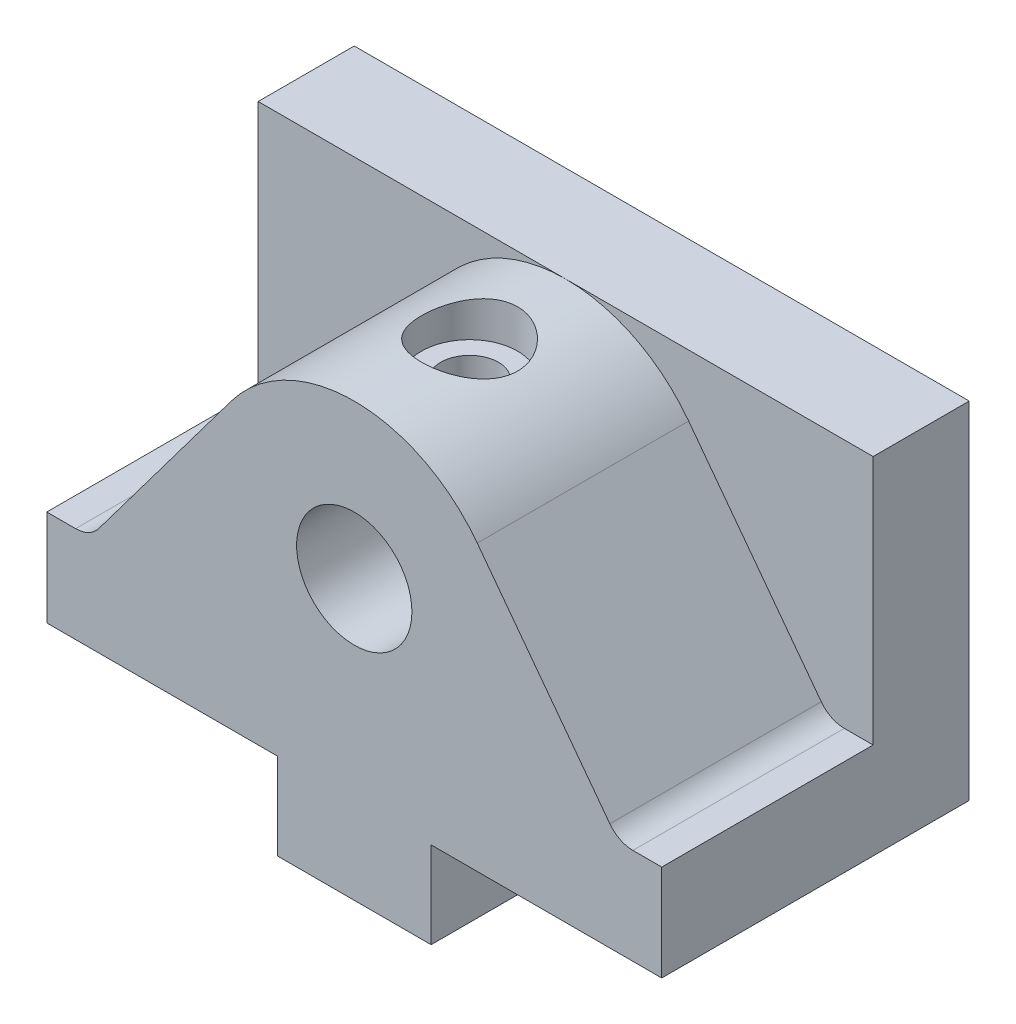
ISO-10303-21;
HEADER;
FILE_DESCRIPTION(('STEP AP214'),'2;1');
FILE_NAME('part.step','',(''),(''),'','','');
FILE_SCHEMA(('AUTOMOTIVE_DESIGN { 1 0 10303 214 1 1 1 1 }'));
ENDSEC;
DATA;
#1=APPLICATION_CONTEXT('core data for automotive mechanical design processes');
#2=APPLICATION_PROTOCOL_DEFINITION('international standard','automotive_design',2000,#1);
#3=PRODUCT_CONTEXT('',#1,'mechanical');
#4=PRODUCT('Part','Part','',(#3));
#5=PRODUCT_RELATED_PRODUCT_CATEGORY('part','',(#4));
#6=PRODUCT_DEFINITION_FORMATION('','',#4);
#7=PRODUCT_DEFINITION_CONTEXT('part definition',#1,'design');
#8=PRODUCT_DEFINITION('design','',#6,#7);
#9=PRODUCT_DEFINITION_SHAPE('','',#8);
#10=(LENGTH_UNIT() NAMED_UNIT(*) SI_UNIT(.MILLI.,.METRE.));
#11=(NAMED_UNIT(*) PLANE_ANGLE_UNIT() SI_UNIT($,.RADIAN.));
#12=(NAMED_UNIT(*) SI_UNIT($,.STERADIAN.) SOLID_ANGLE_UNIT());
#13=UNCERTAINTY_MEASURE_WITH_UNIT(LENGTH_MEASURE(1.E-05),#10,'distance_accuracy_value','');
#14=(GEOMETRIC_REPRESENTATION_CONTEXT(3) GLOBAL_UNCERTAINTY_ASSIGNED_CONTEXT((#13)) GLOBAL_UNIT_ASSIGNED_CONTEXT((#10,
#11,#12)) REPRESENTATION_CONTEXT('',''));
#15=CARTESIAN_POINT('',(0.,0.,0.));
#16=DIRECTION('',(0.,0.,1.));
#17=DIRECTION('',(1.,0.,0.));
#18=AXIS2_PLACEMENT_3D('',#15,#16,#17);
#19=CARTESIAN_POINT('',(32.,20.,10.));
#20=DIRECTION('',(0.,0.,1.));
#21=DIRECTION('',(1.,0.,0.));
#22=AXIS2_PLACEMENT_3D('',#19,#20,#21);
#23=CYLINDRICAL_SURFACE('',#22,6.);
#24=CARTESIAN_POINT('',(32.,20.,10.));
#25=DIRECTION('',(0.,0.,1.));
#26=DIRECTION('',(1.,0.,0.));
#27=AXIS2_PLACEMENT_3D('',#24,#25,#26);
#28=CIRCLE('',#27,6.);
#29=CARTESIAN_POINT('',(38.,20.,10.));
#30=VERTEX_POINT('',#29);
#31=EDGE_CURVE('E442',#30,#30,#28,.T.);
#32=ORIENTED_EDGE('',*,*,#31,.F.);
#33=EDGE_LOOP('',(#32));
#34=FACE_BOUND('',#33,.T.);
#35=CARTESIAN_POINT('',(32.,20.,32.));
#36=DIRECTION('',(0.,0.,1.));
#37=DIRECTION('',(1.,0.,0.));
#38=AXIS2_PLACEMENT_3D('',#35,#36,#37);
#39=CIRCLE('',#38,6.);
#40=CARTESIAN_POINT('',(38.,20.,32.));
#41=VERTEX_POINT('',#40);
#42=EDGE_CURVE('E610',#41,#41,#39,.T.);
#43=ORIENTED_EDGE('',*,*,#42,.T.);
#44=EDGE_LOOP('',(#43));
#45=FACE_BOUND('',#44,.T.);
#46=CARTESIAN_POINT('',(32.,26.,23.));
#47=CARTESIAN_POINT('',(31.9211058523729,25.9999993496415,22.9999991612595));
#48=CARTESIAN_POINT('',(31.8422033795921,25.9984386900238,22.9968820545245));
#49=CARTESIAN_POINT('',(31.6849980087441,25.9922435879326,22.98446072826));
#50=CARTESIAN_POINT('',(31.6066953963795,25.987607762957,22.9751537259346));
#51=CARTESIAN_POINT('',(31.3733713086263,25.9692197802747,22.9380421431814));
#52=CARTESIAN_POINT('',(31.220047105155,25.950987344555,22.9010471709373));
#53=CARTESIAN_POINT('',(30.92316413664,25.9044896674308,22.8044182255708));
#54=CARTESIAN_POINT('',(30.7795699451561,25.8762634436568,22.7448722337916));
#55=CARTESIAN_POINT('',(30.5045917948462,25.8123730271633,22.6052887493211));
#56=CARTESIAN_POINT('',(30.3732068744085,25.7767094209369,22.5252528722967));
#57=CARTESIAN_POINT('',(30.1174729872822,25.6986875229893,22.3414460191505));
#58=CARTESIAN_POINT('',(29.9940305458315,25.6560547458661,22.2365320524786));
#59=CARTESIAN_POINT('',(29.7656654890981,25.5698003362933,22.0084440785134));
#60=CARTESIAN_POINT('',(29.6607569864427,25.5261779786051,21.8852562868347));
#61=CARTESIAN_POINT('',(29.4642313527775,25.4389634796958,21.6125156399182));
#62=CARTESIAN_POINT('',(29.374275888234,25.3956360268673,21.4616590255418));
#63=CARTESIAN_POINT('',(29.2596596854971,25.3378244971939,21.2240491459768));
#64=CARTESIAN_POINT('',(29.2248321311788,25.3197457084025,21.1429290754373));
#65=CARTESIAN_POINT('',(29.1623070040351,25.2866576836529,20.9773994201195));
#66=CARTESIAN_POINT('',(29.1346052191606,25.2716466354339,20.8929918127424));
#67=CARTESIAN_POINT('',(29.0881171973349,25.2461034170808,20.7266042032378));
#68=CARTESIAN_POINT('',(29.0688995770709,25.235358385652,20.6447772032435));
#69=CARTESIAN_POINT('',(29.0373644061532,25.2175778415115,20.4794450914804));
#70=CARTESIAN_POINT('',(29.0250431946489,25.2105403608213,20.3959408944593));
#71=CARTESIAN_POINT('',(29.007486175873,25.2004775664527,20.2279936325838));
#72=CARTESIAN_POINT('',(29.0022461014206,25.1974498364711,20.1435511641063));
#73=CARTESIAN_POINT('',(28.9989154758394,25.1955255596719,19.9745063456586));
#74=CARTESIAN_POINT('',(29.0008242425839,25.1966286187036,19.8899040117121));
#75=CARTESIAN_POINT('',(29.015950264596,25.2053466805927,19.6572461016777));
#76=CARTESIAN_POINT('',(29.0366495736728,25.2172679435374,19.5097558458456));
#77=CARTESIAN_POINT('',(29.0991771996331,25.2522818241212,19.2208063231749));
#78=CARTESIAN_POINT('',(29.1410122470441,25.2753780002338,19.0793489930494));
#79=CARTESIAN_POINT('',(29.245371560627,25.3306256888873,18.8023203497032));
#80=CARTESIAN_POINT('',(29.3083550412968,25.36297559568,18.6669628882489));
#81=CARTESIAN_POINT('',(29.452874694242,25.4331017525131,18.408095036686));
#82=CARTESIAN_POINT('',(29.5344191999248,25.4708804371131,18.2845900035195));
#83=CARTESIAN_POINT('',(29.7258019126025,25.5533948568688,18.0364369062202));
#84=CARTESIAN_POINT('',(29.8379166456512,25.5984053392498,17.9136295576159));
#85=CARTESIAN_POINT('',(30.081333243007,25.6864286668495,17.6877935657979));
#86=CARTESIAN_POINT('',(30.2126442245964,25.7294405499668,17.5847743750941));
#87=CARTESIAN_POINT('',(30.498450488449,25.8110596276946,17.3969430679814));
#88=CARTESIAN_POINT('',(30.6537392267894,25.8493695273188,17.3131985963024));
#89=CARTESIAN_POINT('',(30.9786013519473,25.9147364311806,17.1737088992422));
#90=CARTESIAN_POINT('',(31.1481632707963,25.9418023676751,17.1179414414504));
#91=CARTESIAN_POINT('',(31.481700525392,25.9797300128223,17.0405737920639));
#92=CARTESIAN_POINT('',(31.6449754084549,25.9917481491937,17.0165262936183));
#93=CARTESIAN_POINT('',(31.9736612000521,26.0021904036188,16.9956058057383));
#94=CARTESIAN_POINT('',(32.1390710595843,26.0006209616012,16.9987199428605));
#95=CARTESIAN_POINT('',(32.4536989159814,25.9847357676384,17.0306200654602));
#96=CARTESIAN_POINT('',(32.6031782241551,25.9714173706497,17.0573975982439));
#97=CARTESIAN_POINT('',(32.8952206769005,25.9346651394405,17.1327142156314));
#98=CARTESIAN_POINT('',(33.0377830570753,25.911230190049,17.1812556993486));
#99=CARTESIAN_POINT('',(33.3166658253466,25.8555275423906,17.2999953993113));
#100=CARTESIAN_POINT('',(33.452691191003,25.8230264530147,17.3707731503413));
#101=CARTESIAN_POINT('',(33.7113840851122,25.7523192295968,17.5313226069473));
#102=CARTESIAN_POINT('',(33.8340458893851,25.7141106672883,17.6211024038287));
#103=CARTESIAN_POINT('',(34.0753030678048,25.6312466397789,17.8272812759437));
#104=CARTESIAN_POINT('',(34.1923162332156,25.5863265441049,17.9454286051448));
#105=CARTESIAN_POINT('',(34.405568963013,25.497871747068,18.1997754536848));
#106=CARTESIAN_POINT('',(34.5017941568685,25.4543380217028,18.3359873565804));
#107=CARTESIAN_POINT('',(34.675123743717,25.3715357665078,18.6309309624803));
#108=CARTESIAN_POINT('',(34.7510764881702,25.3325758876393,18.7904337979626));
#109=CARTESIAN_POINT('',(34.8742484770356,25.2672221688566,19.1225302030454));
#110=CARTESIAN_POINT('',(34.9215047448084,25.2408121470948,19.2951065806432));
#111=CARTESIAN_POINT('',(34.9815850649252,25.2068450303742,19.6307306675309));
#112=CARTESIAN_POINT('',(34.997278998202,25.1977215024558,19.7931027562903));
#113=CARTESIAN_POINT('',(35.0020674541469,25.1949606407435,20.1183412055073));
#114=CARTESIAN_POINT('',(34.9911735064729,25.2013165943727,20.2812073211427));
#115=CARTESIAN_POINT('',(34.9457784069952,25.227135856483,20.5864504910935));
#116=CARTESIAN_POINT('',(34.9136250507814,25.2452928164687,20.7293013622656));
#117=CARTESIAN_POINT('',(34.8295259668863,25.2911305036465,21.0074244064572));
#118=CARTESIAN_POINT('',(34.7775738724973,25.3188142941166,21.142694125528));
#119=CARTESIAN_POINT('',(34.6514476638243,25.3828558394063,21.4118743616646));
#120=CARTESIAN_POINT('',(34.5760150598808,25.4196713966662,21.5450829694789));
#121=CARTESIAN_POINT('',(34.4064512676201,25.4970602244007,21.7978243449357));
#122=CARTESIAN_POINT('',(34.3123103512076,25.5376354439705,21.9173499464044));
#123=CARTESIAN_POINT('',(34.094616891292,25.6238685394751,22.1544228574881));
#124=CARTESIAN_POINT('',(33.9688805218339,25.6695449437195,22.2699651241614));
#125=CARTESIAN_POINT('',(33.6984371507704,25.7563371235633,22.478801140071));
#126=CARTESIAN_POINT('',(33.5537199885018,25.7974504345613,22.5720828970222));
#127=CARTESIAN_POINT('',(33.3245233353341,25.8525140684199,22.6931781845566));
#128=CARTESIAN_POINT('',(33.2457531477579,25.8698252424274,22.7305202002416));
#129=CARTESIAN_POINT('',(33.0847972549272,25.9016884596254,22.7983616788238));
#130=CARTESIAN_POINT('',(33.0026132480538,25.9162418552376,22.8288644970335));
#131=CARTESIAN_POINT('',(32.8356169979157,25.9421269018512,22.8826072559925));
#132=CARTESIAN_POINT('',(32.7508109401307,25.9534655761548,22.905863040764));
#133=CARTESIAN_POINT('',(32.5791423574084,25.9726077187874,22.9448825727806));
#134=CARTESIAN_POINT('',(32.4922811228255,25.9804133464694,22.9606508965564));
#135=CARTESIAN_POINT('',(32.3378248953155,25.9908582985537,22.9816846786135));
#136=CARTESIAN_POINT('',(32.2704951620953,25.9942803541452,22.988546917726));
#137=CARTESIAN_POINT('',(32.1354456713818,25.9988515153836,22.9977050014431));
#138=CARTESIAN_POINT('',(32.0677259031749,26.0000005582938,23.0000007200085));
#139=CARTESIAN_POINT('',(32.,26.,23.));
#140=B_SPLINE_CURVE_WITH_KNOTS('',3,(#46,#47,#48,#49,#50,#51,#52,#53,#54,#55,#56,#57,#58,#59,
#60,#61,#62,#63,#64,#65,#66,#67,#68,#69,#70,#71,#72,#73,#74,#75,#76,#77,#78,#79,#80,#81,#82,#83,
#84,#85,#86,#87,#88,#89,#90,#91,#92,#93,#94,#95,#96,#97,#98,#99,#100,#101,#102,#103,#104,#105,
#106,#107,#108,#109,#110,#111,#112,#113,#114,#115,#116,#117,#118,#119,#120,#121,#122,#123,#124,
#125,#126,#127,#128,#129,#130,#131,#132,#133,#134,#135,#136,#137,#138,#139),.UNSPECIFIED.,.T.,
.F.,(4,2,2,2,2,2,2,2,2,2,2,2,2,2,2,2,2,2,2,2,2,2,2,2,2,2,2,2,2,2,2,2,2,2,2,2,2,2,2,2,2,2,2,2,2,
2,4),(0.,0.236611432443577,0.473329310437698,0.947100987304417,1.41904300465372,
1.89094781992153,2.3914018143311,2.89223525113894,3.43190833109941,3.70192714967837,
3.97178599119154,4.2256372003331,4.47935352842581,4.73291689564224,4.98645606901568,
5.43238672147391,5.87845946700878,6.33492255429304,6.79159098704508,7.30616358925478,
7.82098138719902,8.35970601567165,8.89800185660682,9.3917140633788,9.88519228458271,
10.3404225444221,10.7957029981664,11.2640010300754,11.7324988716886,12.2470036685628,
12.7618630076938,13.3016558140826,13.8407507075944,14.3280945743223,14.8152271451712,
15.2559532566965,15.6968212128814,16.1673090526395,16.6380421835398,17.1659726319345,
17.6941868506379,17.9605054214138,18.2266930489272,18.4922945660822,18.7577335310501,
18.9608446764332,19.1639614277476),.UNSPECIFIED.);
#141=CARTESIAN_POINT('',(32.,26.,23.));
#142=VERTEX_POINT('',#141);
#143=EDGE_CURVE('E597',#142,#142,#140,.T.);
#144=ORIENTED_EDGE('',*,*,#143,.F.);
#145=EDGE_LOOP('',(#144));
#146=FACE_BOUND('',#145,.T.);
#147=ADVANCED_FACE('F115',(#34,#45,#146),#23,.F.);
#148=CARTESIAN_POINT('',(0.,36.,32.));
#149=DIRECTION('',(0.,-1.,0.));
#150=DIRECTION('',(0.,0.,-1.));
#151=AXIS2_PLACEMENT_3D('',#148,#149,#150);
#152=PLANE('',#151);
#153=DIRECTION('',(-1.,0.,0.));
#154=VECTOR('',#153,1.);
#155=CARTESIAN_POINT('',(0.,36.,10.));
#156=LINE('',#155,#154);
#157=CARTESIAN_POINT('',(64.,36.,10.));
#158=VERTEX_POINT('',#157);
#159=CARTESIAN_POINT('',(32.,36.,10.));
#160=VERTEX_POINT('',#159);
#161=EDGE_CURVE('E432',#158,#160,#156,.T.);
#162=ORIENTED_EDGE('',*,*,#161,.F.);
#163=DIRECTION('',(0.,0.,-1.));
#164=VECTOR('',#163,1.);
#165=CARTESIAN_POINT('',(64.,36.,32.));
#166=LINE('',#165,#164);
#167=CARTESIAN_POINT('',(64.,36.,0.));
#168=VERTEX_POINT('',#167);
#169=EDGE_CURVE('E242',#158,#168,#166,.T.);
#170=ORIENTED_EDGE('',*,*,#169,.T.);
#171=DIRECTION('',(-1.,0.,0.));
#172=VECTOR('',#171,1.);
#173=CARTESIAN_POINT('',(0.,36.,0.));
#174=LINE('',#173,#172);
#175=CARTESIAN_POINT('',(0.,36.,0.));
#176=VERTEX_POINT('',#175);
#177=EDGE_CURVE('E239',#168,#176,#174,.T.);
#178=ORIENTED_EDGE('',*,*,#177,.T.);
#179=DIRECTION('',(0.,0.,-1.));
#180=VECTOR('',#179,1.);
#181=CARTESIAN_POINT('',(0.,36.,32.));
#182=LINE('',#181,#180);
#183=CARTESIAN_POINT('',(0.,36.,10.));
#184=VERTEX_POINT('',#183);
#185=EDGE_CURVE('E174',#184,#176,#182,.T.);
#186=ORIENTED_EDGE('',*,*,#185,.F.);
#187=DIRECTION('',(-1.,0.,0.));
#188=VECTOR('',#187,1.);
#189=CARTESIAN_POINT('',(0.,36.,10.));
#190=LINE('',#189,#188);
#191=EDGE_CURVE('E454',#160,#184,#190,.T.);
#192=ORIENTED_EDGE('',*,*,#191,.F.);
#193=EDGE_LOOP('',(#162,#170,#178,#186,#192));
#194=FACE_BOUND('',#193,.T.);
#195=ADVANCED_FACE('F277',(#194),#152,.F.);
#196=CARTESIAN_POINT('',(0.,0.,32.));
#197=DIRECTION('',(0.,0.,-1.));
#198=DIRECTION('',(-1.,0.,0.));
#199=AXIS2_PLACEMENT_3D('',#196,#197,#198);
#200=PLANE('',#199);
#201=ORIENTED_EDGE('',*,*,#42,.F.);
#202=EDGE_LOOP('',(#201));
#203=FACE_BOUND('',#202,.T.);
#204=DIRECTION('',(0.6,-0.8,0.));
#205=VECTOR('',#204,1.);
#206=CARTESIAN_POINT('',(42.88,32.16,32.));
#207=LINE('',#206,#205);
#208=CARTESIAN_POINT('',(44.8,29.6,32.));
#209=VERTEX_POINT('',#208);
#210=CARTESIAN_POINT('',(58.6,11.2,32.));
#211=VERTEX_POINT('',#210);
#212=EDGE_CURVE('E428',#209,#211,#207,.T.);
#213=ORIENTED_EDGE('',*,*,#212,.F.);
#214=CARTESIAN_POINT('',(32.,20.,32.));
#215=DIRECTION('',(0.,0.,1.));
#216=DIRECTION('',(1.,0.,0.));
#217=AXIS2_PLACEMENT_3D('',#214,#215,#216);
#218=CIRCLE('',#217,16.);
#219=CARTESIAN_POINT('',(19.2,29.6,32.));
#220=VERTEX_POINT('',#219);
#221=EDGE_CURVE('E320',#209,#220,#218,.T.);
#222=ORIENTED_EDGE('',*,*,#221,.T.);
#223=DIRECTION('',(-0.6,-0.8,0.));
#224=VECTOR('',#223,1.);
#225=CARTESIAN_POINT('',(-1.92,1.44,32.));
#226=LINE('',#225,#224);
#227=CARTESIAN_POINT('',(5.40000000000001,11.2,32.));
#228=VERTEX_POINT('',#227);
#229=EDGE_CURVE('E325',#220,#228,#226,.T.);
#230=ORIENTED_EDGE('',*,*,#229,.T.);
#231=CARTESIAN_POINT('',(3.,13.,32.));
#232=DIRECTION('',(0.,0.,1.));
#233=DIRECTION('',(1.,0.,0.));
#234=AXIS2_PLACEMENT_3D('',#231,#232,#233);
#235=CIRCLE('',#234,3.);
#236=CARTESIAN_POINT('',(2.99999999999999,10.,32.));
#237=VERTEX_POINT('',#236);
#238=EDGE_CURVE('E131',#228,#237,#235,.F.);
#239=ORIENTED_EDGE('',*,*,#238,.T.);
#240=DIRECTION('',(1.,0.,0.));
#241=VECTOR('',#240,1.);
#242=CARTESIAN_POINT('',(0.,10.,32.));
#243=LINE('',#242,#241);
#244=CARTESIAN_POINT('',(0.,10.,32.));
#245=VERTEX_POINT('',#244);
#246=EDGE_CURVE('E312',#245,#237,#243,.T.);
#247=ORIENTED_EDGE('',*,*,#246,.F.);
#248=DIRECTION('',(0.,-1.,0.));
#249=VECTOR('',#248,1.);
#250=CARTESIAN_POINT('',(0.,0.,32.));
#251=LINE('',#250,#249);
#252=CARTESIAN_POINT('',(0.,0.,32.));
#253=VERTEX_POINT('',#252);
#254=EDGE_CURVE('E182',#245,#253,#251,.T.);
#255=ORIENTED_EDGE('',*,*,#254,.T.);
#256=DIRECTION('',(1.,0.,0.));
#257=VECTOR('',#256,1.);
#258=CARTESIAN_POINT('',(0.,0.,32.));
#259=LINE('',#258,#257);
#260=CARTESIAN_POINT('',(24.,0.,32.));
#261=VERTEX_POINT('',#260);
#262=EDGE_CURVE('E345',#253,#261,#259,.T.);
#263=ORIENTED_EDGE('',*,*,#262,.T.);
#264=DIRECTION('',(0.,-1.,0.));
#265=VECTOR('',#264,1.);
#266=CARTESIAN_POINT('',(24.,0.,32.));
#267=LINE('',#266,#265);
#268=CARTESIAN_POINT('',(24.,-9.,32.));
#269=VERTEX_POINT('',#268);
#270=EDGE_CURVE('E201',#261,#269,#267,.T.);
#271=ORIENTED_EDGE('',*,*,#270,.T.);
#272=DIRECTION('',(1.,0.,0.));
#273=VECTOR('',#272,1.);
#274=CARTESIAN_POINT('',(24.,-9.,32.));
#275=LINE('',#274,#273);
#276=CARTESIAN_POINT('',(40.,-9.,32.));
#277=VERTEX_POINT('',#276);
#278=EDGE_CURVE('E193',#269,#277,#275,.T.);
#279=ORIENTED_EDGE('',*,*,#278,.T.);
#280=DIRECTION('',(0.,1.,0.));
#281=VECTOR('',#280,1.);
#282=CARTESIAN_POINT('',(40.,0.,32.));
#283=LINE('',#282,#281);
#284=CARTESIAN_POINT('',(40.,0.,32.));
#285=VERTEX_POINT('',#284);
#286=EDGE_CURVE('E198',#277,#285,#283,.T.);
#287=ORIENTED_EDGE('',*,*,#286,.T.);
#288=DIRECTION('',(1.,0.,0.));
#289=VECTOR('',#288,1.);
#290=CARTESIAN_POINT('',(40.,0.,32.));
#291=LINE('',#290,#289);
#292=CARTESIAN_POINT('',(64.,0.,32.));
#293=VERTEX_POINT('',#292);
#294=EDGE_CURVE('E140',#285,#293,#291,.T.);
#295=ORIENTED_EDGE('',*,*,#294,.T.);
#296=DIRECTION('',(0.,1.,0.));
#297=VECTOR('',#296,1.);
#298=CARTESIAN_POINT('',(64.,0.,32.));
#299=LINE('',#298,#297);
#300=CARTESIAN_POINT('',(64.,10.,32.));
#301=VERTEX_POINT('',#300);
#302=EDGE_CURVE('E219',#293,#301,#299,.T.);
#303=ORIENTED_EDGE('',*,*,#302,.T.);
#304=DIRECTION('',(1.,0.,0.));
#305=VECTOR('',#304,1.);
#306=CARTESIAN_POINT('',(0.,10.,32.));
#307=LINE('',#306,#305);
#308=CARTESIAN_POINT('',(61.,10.,32.));
#309=VERTEX_POINT('',#308);
#310=EDGE_CURVE('E371',#309,#301,#307,.T.);
#311=ORIENTED_EDGE('',*,*,#310,.F.);
#312=CARTESIAN_POINT('',(61.,13.,32.));
#313=DIRECTION('',(0.,0.,1.));
#314=DIRECTION('',(1.,0.,0.));
#315=AXIS2_PLACEMENT_3D('',#312,#313,#314);
#316=CIRCLE('',#315,3.);
#317=EDGE_CURVE('E419',#309,#211,#316,.F.);
#318=ORIENTED_EDGE('',*,*,#317,.T.);
#319=EDGE_LOOP('',(#213,#222,#230,#239,#247,#255,#263,#271,#279,#287,#295,#303,#311,#318));
#320=FACE_BOUND('',#319,.T.);
#321=ADVANCED_FACE('F196',(#203,#320),#200,.F.);
#322=CARTESIAN_POINT('',(0.,0.,32.));
#323=DIRECTION('',(1.,0.,0.));
#324=DIRECTION('',(0.,0.,-1.));
#325=AXIS2_PLACEMENT_3D('',#322,#323,#324);
#326=PLANE('',#325);
#327=ORIENTED_EDGE('',*,*,#254,.F.);
#328=DIRECTION('',(0.,0.,1.));
#329=VECTOR('',#328,1.);
#330=CARTESIAN_POINT('',(0.,10.,10.));
#331=LINE('',#330,#329);
#332=CARTESIAN_POINT('',(0.,10.,10.));
#333=VERTEX_POINT('',#332);
#334=EDGE_CURVE('E317',#333,#245,#331,.T.);
#335=ORIENTED_EDGE('',*,*,#334,.F.);
#336=DIRECTION('',(0.,-1.,0.));
#337=VECTOR('',#336,1.);
#338=CARTESIAN_POINT('',(0.,0.,10.));
#339=LINE('',#338,#337);
#340=EDGE_CURVE('E455',#184,#333,#339,.T.);
#341=ORIENTED_EDGE('',*,*,#340,.F.);
#342=ORIENTED_EDGE('',*,*,#185,.T.);
#343=DIRECTION('',(0.,-1.,0.));
#344=VECTOR('',#343,1.);
#345=CARTESIAN_POINT('',(0.,0.,0.));
#346=LINE('',#345,#344);
#347=CARTESIAN_POINT('',(0.,0.,0.));
#348=VERTEX_POINT('',#347);
#349=EDGE_CURVE('E224',#176,#348,#346,.T.);
#350=ORIENTED_EDGE('',*,*,#349,.T.);
#351=DIRECTION('',(0.,0.,-1.));
#352=VECTOR('',#351,1.);
#353=CARTESIAN_POINT('',(0.,0.,32.));
#354=LINE('',#353,#352);
#355=EDGE_CURVE('E124',#253,#348,#354,.T.);
#356=ORIENTED_EDGE('',*,*,#355,.F.);
#357=EDGE_LOOP('',(#327,#335,#341,#342,#350,#356));
#358=FACE_BOUND('',#357,.T.);
#359=ADVANCED_FACE('F117',(#358),#326,.F.);
#360=CARTESIAN_POINT('',(0.,0.,32.));
#361=DIRECTION('',(0.,1.,0.));
#362=DIRECTION('',(-1.,0.,0.));
#363=AXIS2_PLACEMENT_3D('',#360,#361,#362);
#364=PLANE('',#363);
#365=DIRECTION('',(1.,0.,0.));
#366=VECTOR('',#365,1.);
#367=CARTESIAN_POINT('',(0.,0.,0.));
#368=LINE('',#367,#366);
#369=CARTESIAN_POINT('',(24.,0.,0.));
#370=VERTEX_POINT('',#369);
#371=EDGE_CURVE('E226',#348,#370,#368,.T.);
#372=ORIENTED_EDGE('',*,*,#371,.T.);
#373=DIRECTION('',(0.,0.,-1.));
#374=VECTOR('',#373,1.);
#375=CARTESIAN_POINT('',(24.,0.,32.));
#376=LINE('',#375,#374);
#377=EDGE_CURVE('E249',#261,#370,#376,.T.);
#378=ORIENTED_EDGE('',*,*,#377,.F.);
#379=ORIENTED_EDGE('',*,*,#262,.F.);
#380=ORIENTED_EDGE('',*,*,#355,.T.);
#381=EDGE_LOOP('',(#372,#378,#379,#380));
#382=FACE_BOUND('',#381,.T.);
#383=ADVANCED_FACE('F349',(#382),#364,.F.);
#384=CARTESIAN_POINT('',(24.,0.,32.));
#385=DIRECTION('',(1.,0.,0.));
#386=DIRECTION('',(0.,1.,0.));
#387=AXIS2_PLACEMENT_3D('',#384,#385,#386);
#388=PLANE('',#387);
#389=DIRECTION('',(0.,-1.,0.));
#390=VECTOR('',#389,1.);
#391=CARTESIAN_POINT('',(24.,0.,0.));
#392=LINE('',#391,#390);
#393=CARTESIAN_POINT('',(24.,-9.,0.));
#394=VERTEX_POINT('',#393);
#395=EDGE_CURVE('E229',#370,#394,#392,.T.);
#396=ORIENTED_EDGE('',*,*,#395,.T.);
#397=DIRECTION('',(0.,0.,-1.));
#398=VECTOR('',#397,1.);
#399=CARTESIAN_POINT('',(24.,-9.,32.));
#400=LINE('',#399,#398);
#401=EDGE_CURVE('E213',#269,#394,#400,.T.);
#402=ORIENTED_EDGE('',*,*,#401,.F.);
#403=ORIENTED_EDGE('',*,*,#270,.F.);
#404=ORIENTED_EDGE('',*,*,#377,.T.);
#405=EDGE_LOOP('',(#396,#402,#403,#404));
#406=FACE_BOUND('',#405,.T.);
#407=ADVANCED_FACE('F352',(#406),#388,.F.);
#408=CARTESIAN_POINT('',(24.,-9.,32.));
#409=DIRECTION('',(0.,1.,0.));
#410=DIRECTION('',(0.,0.,1.));
#411=AXIS2_PLACEMENT_3D('',#408,#409,#410);
#412=PLANE('',#411);
#413=CARTESIAN_POINT('',(32.,-9.,24.));
#414=DIRECTION('',(0.,-1.,0.));
#415=DIRECTION('',(0.,0.,-1.));
#416=AXIS2_PLACEMENT_3D('',#413,#414,#415);
#417=CIRCLE('',#416,3.);
#418=CARTESIAN_POINT('',(32.,-9.,21.));
#419=VERTEX_POINT('',#418);
#420=EDGE_CURVE('E628',#419,#419,#417,.T.);
#421=ORIENTED_EDGE('',*,*,#420,.F.);
#422=EDGE_LOOP('',(#421));
#423=FACE_BOUND('',#422,.T.);
#424=CARTESIAN_POINT('',(32.,-9.,8.));
#425=DIRECTION('',(0.,-1.,0.));
#426=DIRECTION('',(0.,0.,-1.));
#427=AXIS2_PLACEMENT_3D('',#424,#425,#426);
#428=CIRCLE('',#427,3.);
#429=CARTESIAN_POINT('',(32.,-9.,5.));
#430=VERTEX_POINT('',#429);
#431=EDGE_CURVE('E625',#430,#430,#428,.T.);
#432=ORIENTED_EDGE('',*,*,#431,.F.);
#433=EDGE_LOOP('',(#432));
#434=FACE_BOUND('',#433,.T.);
#435=DIRECTION('',(1.,0.,0.));
#436=VECTOR('',#435,1.);
#437=CARTESIAN_POINT('',(24.,-9.,0.));
#438=LINE('',#437,#436);
#439=CARTESIAN_POINT('',(40.,-9.,0.));
#440=VERTEX_POINT('',#439);
#441=EDGE_CURVE('E210',#394,#440,#438,.T.);
#442=ORIENTED_EDGE('',*,*,#441,.T.);
#443=DIRECTION('',(0.,0.,-1.));
#444=VECTOR('',#443,1.);
#445=CARTESIAN_POINT('',(40.,-9.,32.));
#446=LINE('',#445,#444);
#447=EDGE_CURVE('E207',#277,#440,#446,.T.);
#448=ORIENTED_EDGE('',*,*,#447,.F.);
#449=ORIENTED_EDGE('',*,*,#278,.F.);
#450=ORIENTED_EDGE('',*,*,#401,.T.);
#451=EDGE_LOOP('',(#442,#448,#449,#450));
#452=FACE_BOUND('',#451,.T.);
#453=ADVANCED_FACE('F208',(#423,#434,#452),#412,.F.);
#454=CARTESIAN_POINT('',(40.,0.,32.));
#455=DIRECTION('',(-1.,0.,0.));
#456=DIRECTION('',(0.,-1.,0.));
#457=AXIS2_PLACEMENT_3D('',#454,#455,#456);
#458=PLANE('',#457);
#459=DIRECTION('',(0.,1.,0.));
#460=VECTOR('',#459,1.);
#461=CARTESIAN_POINT('',(40.,0.,0.));
#462=LINE('',#461,#460);
#463=CARTESIAN_POINT('',(40.,0.,0.));
#464=VERTEX_POINT('',#463);
#465=EDGE_CURVE('E232',#440,#464,#462,.T.);
#466=ORIENTED_EDGE('',*,*,#465,.T.);
#467=DIRECTION('',(0.,0.,-1.));
#468=VECTOR('',#467,1.);
#469=CARTESIAN_POINT('',(40.,0.,32.));
#470=LINE('',#469,#468);
#471=EDGE_CURVE('E214',#285,#464,#470,.T.);
#472=ORIENTED_EDGE('',*,*,#471,.F.);
#473=ORIENTED_EDGE('',*,*,#286,.F.);
#474=ORIENTED_EDGE('',*,*,#447,.T.);
#475=EDGE_LOOP('',(#466,#472,#473,#474));
#476=FACE_BOUND('',#475,.T.);
#477=ADVANCED_FACE('F216',(#476),#458,.F.);
#478=CARTESIAN_POINT('',(40.,0.,32.));
#479=DIRECTION('',(0.,1.,0.));
#480=DIRECTION('',(-1.,0.,0.));
#481=AXIS2_PLACEMENT_3D('',#478,#479,#480);
#482=PLANE('',#481);
#483=DIRECTION('',(1.,0.,0.));
#484=VECTOR('',#483,1.);
#485=CARTESIAN_POINT('',(40.,0.,0.));
#486=LINE('',#485,#484);
#487=CARTESIAN_POINT('',(64.,0.,0.));
#488=VERTEX_POINT('',#487);
#489=EDGE_CURVE('E234',#464,#488,#486,.T.);
#490=ORIENTED_EDGE('',*,*,#489,.T.);
#491=DIRECTION('',(0.,0.,-1.));
#492=VECTOR('',#491,1.);
#493=CARTESIAN_POINT('',(64.,0.,32.));
#494=LINE('',#493,#492);
#495=EDGE_CURVE('E244',#293,#488,#494,.T.);
#496=ORIENTED_EDGE('',*,*,#495,.F.);
#497=ORIENTED_EDGE('',*,*,#294,.F.);
#498=ORIENTED_EDGE('',*,*,#471,.T.);
#499=EDGE_LOOP('',(#490,#496,#497,#498));
#500=FACE_BOUND('',#499,.T.);
#501=ADVANCED_FACE('F358',(#500),#482,.F.);
#502=CARTESIAN_POINT('',(64.,0.,32.));
#503=DIRECTION('',(-1.,0.,0.));
#504=DIRECTION('',(0.,0.,1.));
#505=AXIS2_PLACEMENT_3D('',#502,#503,#504);
#506=PLANE('',#505);
#507=DIRECTION('',(0.,1.,0.));
#508=VECTOR('',#507,1.);
#509=CARTESIAN_POINT('',(64.,0.,10.));
#510=LINE('',#509,#508);
#511=CARTESIAN_POINT('',(64.,10.,10.));
#512=VERTEX_POINT('',#511);
#513=EDGE_CURVE('E430',#512,#158,#510,.T.);
#514=ORIENTED_EDGE('',*,*,#513,.F.);
#515=DIRECTION('',(0.,0.,1.));
#516=VECTOR('',#515,1.);
#517=CARTESIAN_POINT('',(64.,10.,10.));
#518=LINE('',#517,#516);
#519=EDGE_CURVE('E366',#512,#301,#518,.T.);
#520=ORIENTED_EDGE('',*,*,#519,.T.);
#521=ORIENTED_EDGE('',*,*,#302,.F.);
#522=ORIENTED_EDGE('',*,*,#495,.T.);
#523=DIRECTION('',(0.,1.,0.));
#524=VECTOR('',#523,1.);
#525=CARTESIAN_POINT('',(64.,0.,0.));
#526=LINE('',#525,#524);
#527=EDGE_CURVE('E236',#488,#168,#526,.T.);
#528=ORIENTED_EDGE('',*,*,#527,.T.);
#529=ORIENTED_EDGE('',*,*,#169,.F.);
#530=EDGE_LOOP('',(#514,#520,#521,#522,#528,#529));
#531=FACE_BOUND('',#530,.T.);
#532=ADVANCED_FACE('F363',(#531),#506,.F.);
#533=CARTESIAN_POINT('',(0.,0.,0.));
#534=DIRECTION('',(0.,0.,-1.));
#535=DIRECTION('',(-1.,0.,0.));
#536=AXIS2_PLACEMENT_3D('',#533,#534,#535);
#537=PLANE('',#536);
#538=ORIENTED_EDGE('',*,*,#349,.F.);
#539=ORIENTED_EDGE('',*,*,#177,.F.);
#540=ORIENTED_EDGE('',*,*,#527,.F.);
#541=ORIENTED_EDGE('',*,*,#489,.F.);
#542=ORIENTED_EDGE('',*,*,#465,.F.);
#543=ORIENTED_EDGE('',*,*,#441,.F.);
#544=ORIENTED_EDGE('',*,*,#395,.F.);
#545=ORIENTED_EDGE('',*,*,#371,.F.);
#546=EDGE_LOOP('',(#538,#539,#540,#541,#542,#543,#544,#545));
#547=FACE_BOUND('',#546,.T.);
#548=ADVANCED_FACE('F307',(#547),#537,.T.);
#549=CARTESIAN_POINT('',(3.,13.,10.));
#550=DIRECTION('',(0.,0.,1.));
#551=DIRECTION('',(1.,0.,0.));
#552=AXIS2_PLACEMENT_3D('',#549,#550,#551);
#553=CYLINDRICAL_SURFACE('',#552,3.);
#554=ORIENTED_EDGE('',*,*,#238,.F.);
#555=DIRECTION('',(0.,0.,1.));
#556=VECTOR('',#555,1.);
#557=CARTESIAN_POINT('',(5.40000000000001,11.2,10.));
#558=LINE('',#557,#556);
#559=CARTESIAN_POINT('',(5.40000000000001,11.2,10.));
#560=VERTEX_POINT('',#559);
#561=EDGE_CURVE('E342',#560,#228,#558,.T.);
#562=ORIENTED_EDGE('',*,*,#561,.F.);
#563=CARTESIAN_POINT('',(3.,13.,10.));
#564=DIRECTION('',(0.,0.,1.));
#565=DIRECTION('',(1.,0.,0.));
#566=AXIS2_PLACEMENT_3D('',#563,#564,#565);
#567=CIRCLE('',#566,3.);
#568=CARTESIAN_POINT('',(2.99999999999999,10.,10.));
#569=VERTEX_POINT('',#568);
#570=EDGE_CURVE('E319',#560,#569,#567,.F.);
#571=ORIENTED_EDGE('',*,*,#570,.T.);
#572=DIRECTION('',(0.,0.,1.));
#573=VECTOR('',#572,1.);
#574=CARTESIAN_POINT('',(2.99999999999999,10.,10.));
#575=LINE('',#574,#573);
#576=EDGE_CURVE('E227',#569,#237,#575,.T.);
#577=ORIENTED_EDGE('',*,*,#576,.T.);
#578=EDGE_LOOP('',(#554,#562,#571,#577));
#579=FACE_BOUND('',#578,.T.);
#580=ADVANCED_FACE('F300',(#579),#553,.F.);
#581=CARTESIAN_POINT('',(0.,10.,10.));
#582=DIRECTION('',(0.,-1.,0.));
#583=DIRECTION('',(1.,0.,0.));
#584=AXIS2_PLACEMENT_3D('',#581,#582,#583);
#585=PLANE('',#584);
#586=ORIENTED_EDGE('',*,*,#246,.T.);
#587=ORIENTED_EDGE('',*,*,#576,.F.);
#588=DIRECTION('',(1.,0.,0.));
#589=VECTOR('',#588,1.);
#590=CARTESIAN_POINT('',(0.,10.,10.));
#591=LINE('',#590,#589);
#592=EDGE_CURVE('E333',#333,#569,#591,.T.);
#593=ORIENTED_EDGE('',*,*,#592,.F.);
#594=ORIENTED_EDGE('',*,*,#334,.T.);
#595=EDGE_LOOP('',(#586,#587,#593,#594));
#596=FACE_BOUND('',#595,.T.);
#597=ADVANCED_FACE('F298',(#596),#585,.F.);
#598=CARTESIAN_POINT('',(32.,20.,10.));
#599=DIRECTION('',(0.,0.,1.));
#600=DIRECTION('',(1.,0.,0.));
#601=AXIS2_PLACEMENT_3D('',#598,#599,#600);
#602=CYLINDRICAL_SURFACE('',#601,16.);
#603=CARTESIAN_POINT('',(32.,36.,25.));
#604=CARTESIAN_POINT('',(32.2737567406982,35.9999986351195,24.9999982136497));
#605=CARTESIAN_POINT('',(32.5475322100114,35.9929077993933,24.9774430922222));
#606=CARTESIAN_POINT('',(33.0870768383538,35.9653157635526,24.888055033843));
#607=CARTESIAN_POINT('',(33.3528441709037,35.9448115279957,24.8212120745424));
#608=CARTESIAN_POINT('',(33.8685141746031,35.892632627915,24.6457225152172));
#609=CARTESIAN_POINT('',(34.1184407079428,35.860975259956,24.5371406213887));
#610=CARTESIAN_POINT('',(34.5965392093862,35.7897587664487,24.2815307292862));
#611=CARTESIAN_POINT('',(34.8247077417809,35.7501983960149,24.1344966728757));
#612=CARTESIAN_POINT('',(35.2598613398077,35.6660085495921,23.8013760319326));
#613=CARTESIAN_POINT('',(35.4660801126212,35.621268637007,23.6143164597633));
#614=CARTESIAN_POINT('',(35.8447895281534,35.5324018550409,23.2085264303382));
#615=CARTESIAN_POINT('',(36.0172738916151,35.4882751012093,22.9897900899934));
#616=CARTESIAN_POINT('',(36.3277734593064,35.4044457876485,22.5202217447927));
#617=CARTESIAN_POINT('',(36.4648313659311,35.3648795310221,22.2687300899923));
#618=CARTESIAN_POINT('',(36.6943896429924,35.2963120709366,21.7448307401774));
#619=CARTESIAN_POINT('',(36.7869017508585,35.2673080849026,21.4724285768566));
#620=CARTESIAN_POINT('',(36.9219383972186,35.224304279618,20.9230876901663));
#621=CARTESIAN_POINT('',(36.9658844003162,35.2098789171452,20.6465326254318));
#622=CARTESIAN_POINT('',(37.0069822014779,35.1964022056731,20.0896275243652));
#623=CARTESIAN_POINT('',(37.0041464398417,35.1973467694717,19.809278516739));
#624=CARTESIAN_POINT('',(36.9528729892982,35.2141275626545,19.2645021588889));
#625=CARTESIAN_POINT('',(36.9062423147293,35.229373668447,18.9998834964481));
#626=CARTESIAN_POINT('',(36.7716325341796,35.272081024701,18.482431373751));
#627=CARTESIAN_POINT('',(36.6836490337719,35.2995435733467,18.2295991691417));
#628=CARTESIAN_POINT('',(36.4675549872652,35.3640417609542,17.7385922223016));
#629=CARTESIAN_POINT('',(36.3388770264871,35.4012113865356,17.5006855572407));
#630=CARTESIAN_POINT('',(36.0454408295101,35.4808742631002,17.0492489284749));
#631=CARTESIAN_POINT('',(35.8806732208621,35.523368895754,16.8357253189828));
#632=CARTESIAN_POINT('',(35.5108678167296,35.6112611120491,16.4289002263345));
#633=CARTESIAN_POINT('',(35.3043382823716,35.6567027842357,16.2369617688819));
#634=CARTESIAN_POINT('',(34.8614576323818,35.7436628303753,15.8901124256806));
#635=CARTESIAN_POINT('',(34.625104309396,35.7851809135328,15.735204283123));
#636=CARTESIAN_POINT('',(34.1266584418619,35.8600517956098,15.4658892455951));
#637=CARTESIAN_POINT('',(33.8643796276771,35.8933384259289,15.3518074581442));
#638=CARTESIAN_POINT('',(33.3230719111306,35.9475182331416,15.1697879965937));
#639=CARTESIAN_POINT('',(33.0440481228984,35.9684151730059,15.1018363110464));
#640=CARTESIAN_POINT('',(32.4887406291614,35.9948555758007,15.0163278296841));
#641=CARTESIAN_POINT('',(32.2127673951554,36.0009609158175,14.9969258256259));
#642=CARTESIAN_POINT('',(31.6614787770697,35.9987919892393,15.0038649065493));
#643=CARTESIAN_POINT('',(31.386163302774,35.9905198232454,15.0301993092904));
#644=CARTESIAN_POINT('',(30.8511226680966,35.9608945507905,15.1263823704256));
#645=CARTESIAN_POINT('',(30.5911800863163,35.9398717244275,15.19513307045));
#646=CARTESIAN_POINT('',(30.0865922845545,35.8872048551716,15.3728574094669));
#647=CARTESIAN_POINT('',(29.8419489582038,35.8555595005738,15.4818360161));
#648=CARTESIAN_POINT('',(29.3682703733113,35.783941710377,15.7398928661947));
#649=CARTESIAN_POINT('',(29.1397610408488,35.7437850727067,15.8898839499872));
#650=CARTESIAN_POINT('',(28.710536596159,35.6597364001372,16.2246128404697));
#651=CARTESIAN_POINT('',(28.5098290478242,35.6158433539155,16.4093600709786));
#652=CARTESIAN_POINT('',(28.1336501483239,35.5270797953257,16.8170355602084));
#653=CARTESIAN_POINT('',(27.9594939064188,35.4822394682577,17.0411866549569));
#654=CARTESIAN_POINT('',(27.6511499901939,35.3984778838242,17.5165064655071));
#655=CARTESIAN_POINT('',(27.5169616810628,35.3595565324524,17.7676747521079));
#656=CARTESIAN_POINT('',(27.2931966607783,35.2924712932348,18.2893806914819));
#657=CARTESIAN_POINT('',(27.2034472177595,35.264265854275,18.5598385977429));
#658=CARTESIAN_POINT('',(27.0710842272764,35.2220468337724,19.1130899729945));
#659=CARTESIAN_POINT('',(27.0284527434402,35.2080278520491,19.3958787053741));
#660=CARTESIAN_POINT('',(26.992823753675,35.1963317085551,19.9520163503217));
#661=CARTESIAN_POINT('',(26.9976688151346,35.1979441840057,20.2252138153897));
#662=CARTESIAN_POINT('',(27.0516472748467,35.2156036150361,20.7666983397677));
#663=CARTESIAN_POINT('',(27.1007786070995,35.2316498972642,21.0349856275469));
#664=CARTESIAN_POINT('',(27.2404908034553,35.2758725673356,21.5551761583676));
#665=CARTESIAN_POINT('',(27.3304543037597,35.3038679276103,21.8072617643734));
#666=CARTESIAN_POINT('',(27.5487909066,35.3687881701826,22.292961654136));
#667=CARTESIAN_POINT('',(27.6771718222305,35.4057148685869,22.5265721683136));
#668=CARTESIAN_POINT('',(27.9745729994603,35.4861394813401,22.9785838817593));
#669=CARTESIAN_POINT('',(28.1449866590347,35.5298379569183,23.196032518001));
#670=CARTESIAN_POINT('',(28.5191640143808,35.6179599528484,23.599945312448));
#671=CARTESIAN_POINT('',(28.7229366306224,35.6623836642662,23.7864011559642));
#672=CARTESIAN_POINT('',(29.1660533487066,35.7486908780989,24.1291301534517));
#673=CARTESIAN_POINT('',(29.4063417020505,35.7904440692269,24.2842189457998));
#674=CARTESIAN_POINT('',(29.9108834479454,35.8650707718751,24.5515956605578));
#675=CARTESIAN_POINT('',(30.1751273688182,35.8979477726329,24.6639004085673));
#676=CARTESIAN_POINT('',(30.6970094585041,35.9488260293388,24.8343654704339));
#677=CARTESIAN_POINT('',(30.9533186515498,35.9678496322456,24.8962994692214));
#678=CARTESIAN_POINT('',(31.473080418239,35.9934360136194,24.9791134398709));
#679=CARTESIAN_POINT('',(31.7365315354413,36.0000013135858,25.000001719216));
#680=CARTESIAN_POINT('',(32.,36.,25.));
#681=B_SPLINE_CURVE_WITH_KNOTS('',3,(#603,#604,#605,#606,#607,#608,#609,#610,#611,#612,#613,
#614,#615,#616,#617,#618,#619,#620,#621,#622,#623,#624,#625,#626,#627,#628,#629,#630,#631,#632,
#633,#634,#635,#636,#637,#638,#639,#640,#641,#642,#643,#644,#645,#646,#647,#648,#649,#650,#651,
#652,#653,#654,#655,#656,#657,#658,#659,#660,#661,#662,#663,#664,#665,#666,#667,#668,#669,#670,
#671,#672,#673,#674,#675,#676,#677,#678,#679,#680),.UNSPECIFIED.,.T.,.F.,(4,2,2,2,2,2,2,2,2,2,2,
2,2,2,2,2,2,2,2,2,2,2,2,2,2,2,2,2,2,2,2,2,2,2,2,2,2,2,4),(0.,0.820301797730038,1.64078929339626,
2.46000991680975,3.27935968623357,4.12151288780633,4.96382269725105,5.82695084991453,
6.68985145121463,7.52676600672194,8.36345801183908,9.16707669695194,9.970780799256,
10.7862257089153,11.6018826405078,12.4546698912775,13.3075202966256,14.1670184276843,
15.0262553798756,15.852302742023,16.678229426068,17.4836250690084,18.2891202014735,
19.1142529896272,19.9396098284639,20.7976711486191,21.655718839442,22.5104046302277,
23.3647649559871,24.1804881394266,24.9961732705188,25.7999165363422,26.6038233736823,
27.4391805607299,28.274761495409,29.1376267255319,30.0001522671289,30.789785466537,
31.5792588309973),.UNSPECIFIED.);
#682=CARTESIAN_POINT('',(32.,36.,25.));
#683=VERTEX_POINT('',#682);
#684=EDGE_CURVE('E12',#683,#683,#681,.T.);
#685=ORIENTED_EDGE('',*,*,#684,.F.);
#686=EDGE_LOOP('',(#685));
#687=FACE_BOUND('',#686,.T.);
#688=ORIENTED_EDGE('',*,*,#221,.F.);
#689=DIRECTION('',(0.,0.,1.));
#690=VECTOR('',#689,1.);
#691=CARTESIAN_POINT('',(44.8,29.6,10.));
#692=LINE('',#691,#690);
#693=CARTESIAN_POINT('',(44.8,29.6,10.));
#694=VERTEX_POINT('',#693);
#695=EDGE_CURVE('E330',#694,#209,#692,.T.);
#696=ORIENTED_EDGE('',*,*,#695,.F.);
#697=CARTESIAN_POINT('',(32.,20.,10.));
#698=DIRECTION('',(0.,0.,1.));
#699=DIRECTION('',(1.,0.,0.));
#700=AXIS2_PLACEMENT_3D('',#697,#698,#699);
#701=CIRCLE('',#700,16.);
#702=EDGE_CURVE('E437',#694,#160,#701,.T.);
#703=ORIENTED_EDGE('',*,*,#702,.T.);
#704=CARTESIAN_POINT('',(32.,20.,10.));
#705=DIRECTION('',(0.,0.,1.));
#706=DIRECTION('',(1.,0.,0.));
#707=AXIS2_PLACEMENT_3D('',#704,#705,#706);
#708=CIRCLE('',#707,16.);
#709=CARTESIAN_POINT('',(19.2,29.6,10.));
#710=VERTEX_POINT('',#709);
#711=EDGE_CURVE('E452',#160,#710,#708,.T.);
#712=ORIENTED_EDGE('',*,*,#711,.T.);
#713=DIRECTION('',(0.,0.,1.));
#714=VECTOR('',#713,1.);
#715=CARTESIAN_POINT('',(19.2,29.6,10.));
#716=LINE('',#715,#714);
#717=EDGE_CURVE('E339',#710,#220,#716,.T.);
#718=ORIENTED_EDGE('',*,*,#717,.T.);
#719=EDGE_LOOP('',(#688,#696,#703,#712,#718));
#720=FACE_BOUND('',#719,.T.);
#721=ADVANCED_FACE('F258',(#687,#720),#602,.T.);
#722=CARTESIAN_POINT('',(-1.92,1.44,10.));
#723=DIRECTION('',(-0.8,0.6,0.));
#724=DIRECTION('',(-0.6,-0.8,0.));
#725=AXIS2_PLACEMENT_3D('',#722,#723,#724);
#726=PLANE('',#725);
#727=ORIENTED_EDGE('',*,*,#229,.F.);
#728=ORIENTED_EDGE('',*,*,#717,.F.);
#729=DIRECTION('',(-0.6,-0.8,0.));
#730=VECTOR('',#729,1.);
#731=CARTESIAN_POINT('',(-1.92,1.44,10.));
#732=LINE('',#731,#730);
#733=EDGE_CURVE('E450',#710,#560,#732,.T.);
#734=ORIENTED_EDGE('',*,*,#733,.T.);
#735=ORIENTED_EDGE('',*,*,#561,.T.);
#736=EDGE_LOOP('',(#727,#728,#734,#735));
#737=FACE_BOUND('',#736,.T.);
#738=ADVANCED_FACE('F296',(#737),#726,.T.);
#739=CARTESIAN_POINT('',(0.,0.,10.));
#740=DIRECTION('',(0.,0.,1.));
#741=DIRECTION('',(1.,0.,0.));
#742=AXIS2_PLACEMENT_3D('',#739,#740,#741);
#743=PLANE('',#742);
#744=ORIENTED_EDGE('',*,*,#570,.F.);
#745=ORIENTED_EDGE('',*,*,#733,.F.);
#746=ORIENTED_EDGE('',*,*,#711,.F.);
#747=ORIENTED_EDGE('',*,*,#191,.T.);
#748=ORIENTED_EDGE('',*,*,#340,.T.);
#749=ORIENTED_EDGE('',*,*,#592,.T.);
#750=EDGE_LOOP('',(#744,#745,#746,#747,#748,#749));
#751=FACE_BOUND('',#750,.T.);
#752=ADVANCED_FACE('F293',(#751),#743,.T.);
#753=CARTESIAN_POINT('',(61.,13.,10.));
#754=DIRECTION('',(0.,0.,1.));
#755=DIRECTION('',(1.,0.,0.));
#756=AXIS2_PLACEMENT_3D('',#753,#754,#755);
#757=CYLINDRICAL_SURFACE('',#756,3.);
#758=ORIENTED_EDGE('',*,*,#317,.F.);
#759=DIRECTION('',(0.,0.,1.));
#760=VECTOR('',#759,1.);
#761=CARTESIAN_POINT('',(61.,10.,10.));
#762=LINE('',#761,#760);
#763=CARTESIAN_POINT('',(61.,10.,10.));
#764=VERTEX_POINT('',#763);
#765=EDGE_CURVE('E418',#764,#309,#762,.T.);
#766=ORIENTED_EDGE('',*,*,#765,.F.);
#767=CARTESIAN_POINT('',(61.,13.,10.));
#768=DIRECTION('',(0.,0.,1.));
#769=DIRECTION('',(1.,0.,0.));
#770=AXIS2_PLACEMENT_3D('',#767,#768,#769);
#771=CIRCLE('',#770,3.);
#772=CARTESIAN_POINT('',(58.6,11.2,10.));
#773=VERTEX_POINT('',#772);
#774=EDGE_CURVE('E407',#764,#773,#771,.F.);
#775=ORIENTED_EDGE('',*,*,#774,.T.);
#776=DIRECTION('',(0.,0.,1.));
#777=VECTOR('',#776,1.);
#778=CARTESIAN_POINT('',(58.6,11.2,10.));
#779=LINE('',#778,#777);
#780=EDGE_CURVE('E326',#773,#211,#779,.T.);
#781=ORIENTED_EDGE('',*,*,#780,.T.);
#782=EDGE_LOOP('',(#758,#766,#775,#781));
#783=FACE_BOUND('',#782,.T.);
#784=ADVANCED_FACE('F286',(#783),#757,.F.);
#785=CARTESIAN_POINT('',(42.88,32.16,10.));
#786=DIRECTION('',(-0.8,-0.6,0.));
#787=DIRECTION('',(0.6,-0.8,0.));
#788=AXIS2_PLACEMENT_3D('',#785,#786,#787);
#789=PLANE('',#788);
#790=ORIENTED_EDGE('',*,*,#212,.T.);
#791=ORIENTED_EDGE('',*,*,#780,.F.);
#792=DIRECTION('',(0.6,-0.8,0.));
#793=VECTOR('',#792,1.);
#794=CARTESIAN_POINT('',(42.88,32.16,10.));
#795=LINE('',#794,#793);
#796=EDGE_CURVE('E421',#694,#773,#795,.T.);
#797=ORIENTED_EDGE('',*,*,#796,.F.);
#798=ORIENTED_EDGE('',*,*,#695,.T.);
#799=EDGE_LOOP('',(#790,#791,#797,#798));
#800=FACE_BOUND('',#799,.T.);
#801=ADVANCED_FACE('F283',(#800),#789,.F.);
#802=CARTESIAN_POINT('',(0.,10.,10.));
#803=DIRECTION('',(0.,-1.,0.));
#804=DIRECTION('',(0.,0.,-1.));
#805=AXIS2_PLACEMENT_3D('',#802,#803,#804);
#806=PLANE('',#805);
#807=ORIENTED_EDGE('',*,*,#310,.T.);
#808=ORIENTED_EDGE('',*,*,#519,.F.);
#809=DIRECTION('',(1.,0.,0.));
#810=VECTOR('',#809,1.);
#811=CARTESIAN_POINT('',(0.,10.,10.));
#812=LINE('',#811,#810);
#813=EDGE_CURVE('E425',#764,#512,#812,.T.);
#814=ORIENTED_EDGE('',*,*,#813,.F.);
#815=ORIENTED_EDGE('',*,*,#765,.T.);
#816=EDGE_LOOP('',(#807,#808,#814,#815));
#817=FACE_BOUND('',#816,.T.);
#818=ADVANCED_FACE('F281',(#817),#806,.F.);
#819=CARTESIAN_POINT('',(0.,0.,10.));
#820=DIRECTION('',(0.,0.,1.));
#821=DIRECTION('',(1.,0.,0.));
#822=AXIS2_PLACEMENT_3D('',#819,#820,#821);
#823=PLANE('',#822);
#824=ORIENTED_EDGE('',*,*,#774,.F.);
#825=ORIENTED_EDGE('',*,*,#813,.T.);
#826=ORIENTED_EDGE('',*,*,#513,.T.);
#827=ORIENTED_EDGE('',*,*,#161,.T.);
#828=ORIENTED_EDGE('',*,*,#702,.F.);
#829=ORIENTED_EDGE('',*,*,#796,.T.);
#830=EDGE_LOOP('',(#824,#825,#826,#827,#828,#829));
#831=FACE_BOUND('',#830,.T.);
#832=ADVANCED_FACE('F273',(#831),#823,.T.);
#833=CARTESIAN_POINT('',(0.,0.,10.));
#834=DIRECTION('',(0.,0.,1.));
#835=DIRECTION('',(1.,0.,0.));
#836=AXIS2_PLACEMENT_3D('',#833,#834,#835);
#837=PLANE('',#836);
#838=ORIENTED_EDGE('',*,*,#31,.T.);
#839=EDGE_LOOP('',(#838));
#840=FACE_BOUND('',#839,.T.);
#841=ADVANCED_FACE('F268',(#840),#837,.T.);
#842=CARTESIAN_POINT('',(32.,32.,20.));
#843=DIRECTION('',(0.,1.,0.));
#844=DIRECTION('',(0.,0.,1.));
#845=AXIS2_PLACEMENT_3D('',#842,#843,#844);
#846=CYLINDRICAL_SURFACE('',#845,5.);
#847=ORIENTED_EDGE('',*,*,#684,.T.);
#848=EDGE_LOOP('',(#847));
#849=FACE_BOUND('',#848,.T.);
#850=CARTESIAN_POINT('',(32.,32.,20.));
#851=DIRECTION('',(0.,1.,0.));
#852=DIRECTION('',(0.,0.,1.));
#853=AXIS2_PLACEMENT_3D('',#850,#851,#852);
#854=CIRCLE('',#853,5.);
#855=CARTESIAN_POINT('',(32.,32.,25.));
#856=VERTEX_POINT('',#855);
#857=EDGE_CURVE('E607',#856,#856,#854,.T.);
#858=ORIENTED_EDGE('',*,*,#857,.F.);
#859=EDGE_LOOP('',(#858));
#860=FACE_BOUND('',#859,.T.);
#861=ADVANCED_FACE('F262',(#849,#860),#846,.F.);
#862=CARTESIAN_POINT('',(32.,32.,20.));
#863=DIRECTION('',(0.,1.,0.));
#864=DIRECTION('',(0.,0.,1.));
#865=AXIS2_PLACEMENT_3D('',#862,#863,#864);
#866=PLANE('',#865);
#867=CARTESIAN_POINT('',(32.,32.,20.));
#868=DIRECTION('',(0.,1.,0.));
#869=DIRECTION('',(0.,0.,1.));
#870=AXIS2_PLACEMENT_3D('',#867,#868,#869);
#871=CIRCLE('',#870,3.);
#872=CARTESIAN_POINT('',(32.,32.,23.));
#873=VERTEX_POINT('',#872);
#874=EDGE_CURVE('E119',#873,#873,#871,.F.);
#875=ORIENTED_EDGE('',*,*,#874,.T.);
#876=EDGE_LOOP('',(#875));
#877=FACE_BOUND('',#876,.T.);
#878=ORIENTED_EDGE('',*,*,#857,.T.);
#879=EDGE_LOOP('',(#878));
#880=FACE_BOUND('',#879,.T.);
#881=ADVANCED_FACE('F267',(#877,#880),#866,.T.);
#882=CARTESIAN_POINT('',(32.,36.,20.));
#883=DIRECTION('',(0.,-1.,0.));
#884=DIRECTION('',(0.,0.,-1.));
#885=AXIS2_PLACEMENT_3D('',#882,#883,#884);
#886=CYLINDRICAL_SURFACE('',#885,3.);
#887=ORIENTED_EDGE('',*,*,#874,.F.);
#888=EDGE_LOOP('',(#887));
#889=FACE_BOUND('',#888,.T.);
#890=ORIENTED_EDGE('',*,*,#143,.T.);
#891=EDGE_LOOP('',(#890));
#892=FACE_BOUND('',#891,.T.);
#893=ADVANCED_FACE('F521',(#889,#892),#886,.F.);
#894=CARTESIAN_POINT('',(32.,7.,8.));
#895=DIRECTION('',(0.,-1.,0.));
#896=DIRECTION('',(0.,0.,-1.));
#897=AXIS2_PLACEMENT_3D('',#894,#895,#896);
#898=CYLINDRICAL_SURFACE('',#897,3.);
#899=CARTESIAN_POINT('',(32.,7.,8.));
#900=DIRECTION('',(0.,-1.,0.));
#901=DIRECTION('',(0.,0.,-1.));
#902=AXIS2_PLACEMENT_3D('',#899,#900,#901);
#903=CIRCLE('',#902,3.);
#904=CARTESIAN_POINT('',(32.,7.,5.));
#905=VERTEX_POINT('',#904);
#906=EDGE_CURVE('E605',#905,#905,#903,.T.);
#907=ORIENTED_EDGE('',*,*,#906,.F.);
#908=EDGE_LOOP('',(#907));
#909=FACE_BOUND('',#908,.T.);
#910=ORIENTED_EDGE('',*,*,#431,.T.);
#911=EDGE_LOOP('',(#910));
#912=FACE_BOUND('',#911,.T.);
#913=ADVANCED_FACE('F530',(#909,#912),#898,.F.);
#914=CARTESIAN_POINT('',(32.,7.,8.));
#915=DIRECTION('',(0.,-1.,0.));
#916=DIRECTION('',(0.,0.,-1.));
#917=AXIS2_PLACEMENT_3D('',#914,#915,#916);
#918=PLANE('',#917);
#919=ORIENTED_EDGE('',*,*,#906,.T.);
#920=EDGE_LOOP('',(#919));
#921=FACE_BOUND('',#920,.T.);
#922=ADVANCED_FACE('F548',(#921),#918,.T.);
#923=CARTESIAN_POINT('',(32.,7.,24.));
#924=DIRECTION('',(0.,-1.,0.));
#925=DIRECTION('',(0.,0.,-1.));
#926=AXIS2_PLACEMENT_3D('',#923,#924,#925);
#927=CYLINDRICAL_SURFACE('',#926,3.);
#928=CARTESIAN_POINT('',(32.,7.,24.));
#929=DIRECTION('',(0.,-1.,0.));
#930=DIRECTION('',(0.,0.,-1.));
#931=AXIS2_PLACEMENT_3D('',#928,#929,#930);
#932=CIRCLE('',#931,3.);
#933=CARTESIAN_POINT('',(32.,7.,21.));
#934=VERTEX_POINT('',#933);
#935=EDGE_CURVE('E604',#934,#934,#932,.T.);
#936=ORIENTED_EDGE('',*,*,#935,.F.);
#937=EDGE_LOOP('',(#936));
#938=FACE_BOUND('',#937,.T.);
#939=ORIENTED_EDGE('',*,*,#420,.T.);
#940=EDGE_LOOP('',(#939));
#941=FACE_BOUND('',#940,.T.);
#942=ADVANCED_FACE('F559',(#938,#941),#927,.F.);
#943=CARTESIAN_POINT('',(32.,7.,24.));
#944=DIRECTION('',(0.,-1.,0.));
#945=DIRECTION('',(0.,0.,-1.));
#946=AXIS2_PLACEMENT_3D('',#943,#944,#945);
#947=PLANE('',#946);
#948=ORIENTED_EDGE('',*,*,#935,.T.);
#949=EDGE_LOOP('',(#948));
#950=FACE_BOUND('',#949,.T.);
#951=ADVANCED_FACE('F570',(#950),#947,.T.);
#952=CLOSED_SHELL('',(#147,#195,#321,#359,#383,#407,#453,#477,#501,#532,#548,#580,#597,#721,
#738,#752,#784,#801,#818,#832,#841,#861,#881,#893,#913,#922,#942,#951));
#953=MANIFOLD_SOLID_BREP('B2',#952);
#954=ADVANCED_BREP_SHAPE_REPRESENTATION('',(#18,#953),#14);
#955=SHAPE_DEFINITION_REPRESENTATION(#9,#954);
ENDSEC;
END-ISO-10303-21;
